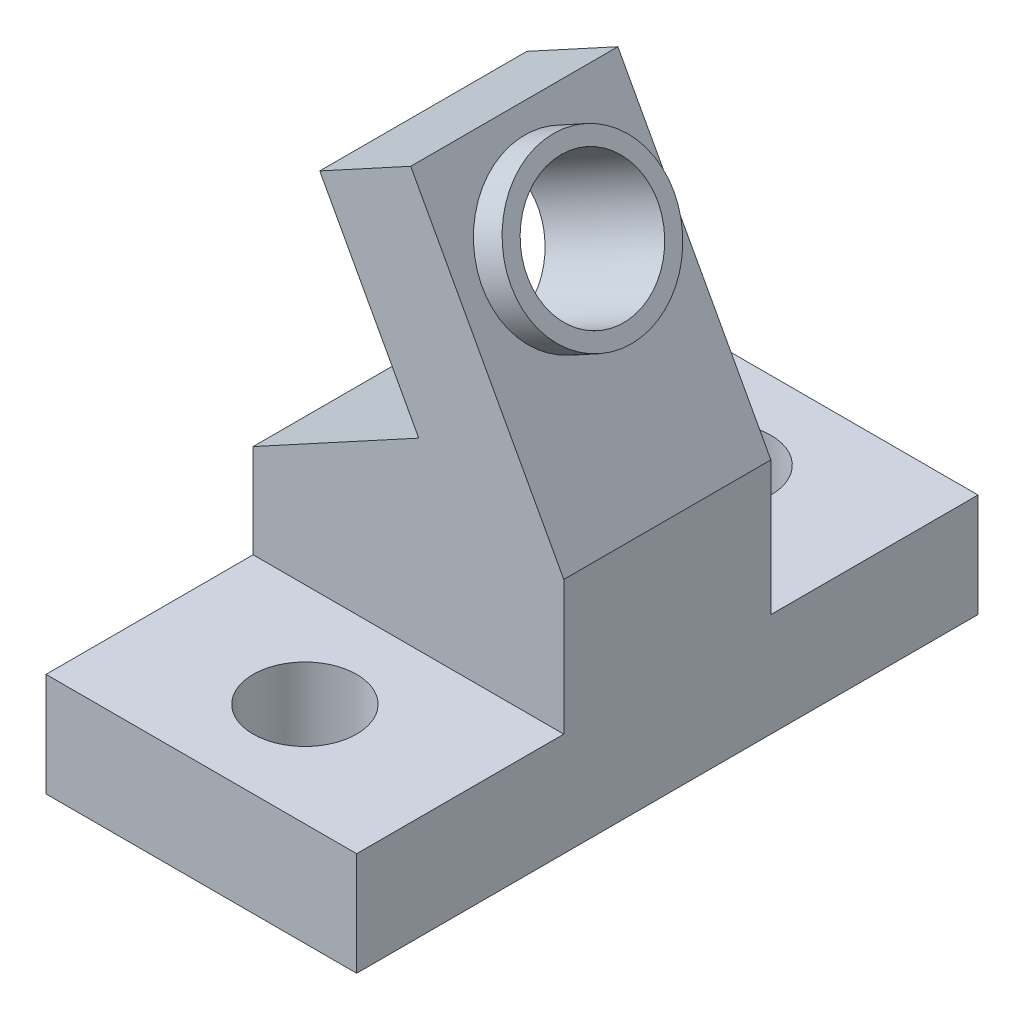
ISO-10303-21;
HEADER;
FILE_DESCRIPTION(('STEP AP214'),'2;1');
FILE_NAME('part.step','',(''),(''),'','','');
FILE_SCHEMA(('AUTOMOTIVE_DESIGN { 1 0 10303 214 1 1 1 1 }'));
ENDSEC;
DATA;
#1=APPLICATION_CONTEXT('core data for automotive mechanical design processes');
#2=APPLICATION_PROTOCOL_DEFINITION('international standard','automotive_design',2000,#1);
#3=PRODUCT_CONTEXT('',#1,'mechanical');
#4=PRODUCT('Part','Part','',(#3));
#5=PRODUCT_RELATED_PRODUCT_CATEGORY('part','',(#4));
#6=PRODUCT_DEFINITION_FORMATION('','',#4);
#7=PRODUCT_DEFINITION_CONTEXT('part definition',#1,'design');
#8=PRODUCT_DEFINITION('design','',#6,#7);
#9=PRODUCT_DEFINITION_SHAPE('','',#8);
#10=(LENGTH_UNIT() NAMED_UNIT(*) SI_UNIT(.MILLI.,.METRE.));
#11=(NAMED_UNIT(*) PLANE_ANGLE_UNIT() SI_UNIT($,.RADIAN.));
#12=(NAMED_UNIT(*) SI_UNIT($,.STERADIAN.) SOLID_ANGLE_UNIT());
#13=UNCERTAINTY_MEASURE_WITH_UNIT(LENGTH_MEASURE(1.E-05),#10,'distance_accuracy_value','');
#14=(GEOMETRIC_REPRESENTATION_CONTEXT(3) GLOBAL_UNCERTAINTY_ASSIGNED_CONTEXT((#13)) GLOBAL_UNIT_ASSIGNED_CONTEXT((#10,
#11,#12)) REPRESENTATION_CONTEXT('',''));
#15=CARTESIAN_POINT('',(0.,0.,0.));
#16=DIRECTION('',(0.,0.,1.));
#17=DIRECTION('',(1.,0.,0.));
#18=AXIS2_PLACEMENT_3D('',#15,#16,#17);
#19=CARTESIAN_POINT('',(12.7,2.89358929940263,12.7));
#20=DIRECTION('',(-0.878400378515024,-0.477925491080632,0.));
#21=DIRECTION('',(0.477925491080632,-0.878400378515024,0.));
#22=AXIS2_PLACEMENT_3D('',#19,#20,#21);
#23=PLANE('',#22);
#24=DIRECTION('',(-0.477925491080632,0.878400378515024,0.));
#25=VECTOR('',#24,1.);
#26=CARTESIAN_POINT('',(12.7,2.89358929940263,0.));
#27=LINE('',#26,#25);
#28=CARTESIAN_POINT('',(6.34999999999999,14.5645348916924,0.));
#29=VERTEX_POINT('',#28);
#30=CARTESIAN_POINT('',(-3.03482686836203,31.8133228875525,0.));
#31=VERTEX_POINT('',#30);
#32=EDGE_CURVE('E133',#29,#31,#27,.T.);
#33=ORIENTED_EDGE('',*,*,#32,.T.);
#34=DIRECTION('',(0.,0.,1.));
#35=VECTOR('',#34,1.);
#36=CARTESIAN_POINT('',(-3.03482686836203,31.8133228875525,0.));
#37=LINE('',#36,#35);
#38=CARTESIAN_POINT('',(-3.03482686836203,31.8133228875525,12.7));
#39=VERTEX_POINT('',#38);
#40=EDGE_CURVE('E118',#31,#39,#37,.T.);
#41=ORIENTED_EDGE('',*,*,#40,.T.);
#42=DIRECTION('',(-0.477925491080632,0.878400378515024,0.));
#43=VECTOR('',#42,1.);
#44=CARTESIAN_POINT('',(12.7,2.89358929940263,12.7));
#45=LINE('',#44,#43);
#46=CARTESIAN_POINT('',(6.34999999999999,14.5645348916924,12.7));
#47=VERTEX_POINT('',#46);
#48=EDGE_CURVE('E142',#47,#39,#45,.T.);
#49=ORIENTED_EDGE('',*,*,#48,.F.);
#50=DIRECTION('',(0.,0.,1.));
#51=VECTOR('',#50,1.);
#52=CARTESIAN_POINT('',(6.34999999999999,14.5645348916924,0.));
#53=LINE('',#52,#51);
#54=EDGE_CURVE('E138',#29,#47,#53,.T.);
#55=ORIENTED_EDGE('',*,*,#54,.F.);
#56=EDGE_LOOP('',(#33,#41,#49,#55));
#57=FACE_BOUND('',#56,.T.);
#58=CARTESIAN_POINT('',(0.,26.2354804839821,6.35000000000001));
#59=DIRECTION('',(-0.878400378515024,-0.477925491080632,0.));
#60=DIRECTION('',(0.477925491080632,-0.878400378515024,0.));
#61=AXIS2_PLACEMENT_3D('',#58,#59,#60);
#62=CIRCLE('',#61,5.);
#63=CARTESIAN_POINT('',(2.38962745540315,21.843478591407,6.35000000000001));
#64=VERTEX_POINT('',#63);
#65=EDGE_CURVE('E11',#64,#64,#62,.F.);
#66=ORIENTED_EDGE('',*,*,#65,.F.);
#67=EDGE_LOOP('',(#66));
#68=FACE_BOUND('',#67,.T.);
#69=ADVANCED_FACE('F33',(#57,#68),#23,.F.);
#70=CARTESIAN_POINT('',(-12.7,49.5773716685615,12.7));
#71=DIRECTION('',(1.,0.,0.));
#72=DIRECTION('',(0.,1.,0.));
#73=AXIS2_PLACEMENT_3D('',#70,#71,#72);
#74=PLANE('',#73);
#75=DIRECTION('',(0.,-1.,0.));
#76=VECTOR('',#75,1.);
#77=CARTESIAN_POINT('',(-12.7,49.5773716685615,12.7));
#78=LINE('',#77,#76);
#79=CARTESIAN_POINT('',(-12.7,12.0965365120771,12.7));
#80=VERTEX_POINT('',#79);
#81=CARTESIAN_POINT('',(-12.7,6.35,12.7));
#82=VERTEX_POINT('',#81);
#83=EDGE_CURVE('E139',#80,#82,#78,.T.);
#84=ORIENTED_EDGE('',*,*,#83,.F.);
#85=DIRECTION('',(0.,0.,1.));
#86=VECTOR('',#85,1.);
#87=CARTESIAN_POINT('',(-12.7,12.0965365120771,0.));
#88=LINE('',#87,#86);
#89=CARTESIAN_POINT('',(-12.7,12.0965365120771,0.));
#90=VERTEX_POINT('',#89);
#91=EDGE_CURVE('E181',#90,#80,#88,.T.);
#92=ORIENTED_EDGE('',*,*,#91,.F.);
#93=DIRECTION('',(0.,-1.,0.));
#94=VECTOR('',#93,1.);
#95=CARTESIAN_POINT('',(-12.7,49.5773716685615,0.));
#96=LINE('',#95,#94);
#97=CARTESIAN_POINT('',(-12.7,6.35,0.));
#98=VERTEX_POINT('',#97);
#99=EDGE_CURVE('E140',#90,#98,#96,.T.);
#100=ORIENTED_EDGE('',*,*,#99,.T.);
#101=DIRECTION('',(0.,0.,1.));
#102=VECTOR('',#101,1.);
#103=CARTESIAN_POINT('',(-12.7,6.35,-12.7));
#104=LINE('',#103,#102);
#105=CARTESIAN_POINT('',(-12.7,6.35,-12.7));
#106=VERTEX_POINT('',#105);
#107=EDGE_CURVE('E49',#106,#98,#104,.T.);
#108=ORIENTED_EDGE('',*,*,#107,.F.);
#109=DIRECTION('',(0.,-1.,0.));
#110=VECTOR('',#109,1.);
#111=CARTESIAN_POINT('',(-12.7,6.35,-12.7));
#112=LINE('',#111,#110);
#113=CARTESIAN_POINT('',(-12.7,0.,-12.7));
#114=VERTEX_POINT('',#113);
#115=EDGE_CURVE('E209',#106,#114,#112,.T.);
#116=ORIENTED_EDGE('',*,*,#115,.T.);
#117=DIRECTION('',(0.,0.,-1.));
#118=VECTOR('',#117,1.);
#119=CARTESIAN_POINT('',(-12.7,0.,12.7));
#120=LINE('',#119,#118);
#121=CARTESIAN_POINT('',(-12.7,0.,25.4));
#122=VERTEX_POINT('',#121);
#123=EDGE_CURVE('E42',#122,#114,#120,.T.);
#124=ORIENTED_EDGE('',*,*,#123,.F.);
#125=DIRECTION('',(0.,-1.,0.));
#126=VECTOR('',#125,1.);
#127=CARTESIAN_POINT('',(-12.7,6.35,25.4));
#128=LINE('',#127,#126);
#129=CARTESIAN_POINT('',(-12.7,6.35,25.4));
#130=VERTEX_POINT('',#129);
#131=EDGE_CURVE('E173',#130,#122,#128,.T.);
#132=ORIENTED_EDGE('',*,*,#131,.F.);
#133=DIRECTION('',(0.,0.,-1.));
#134=VECTOR('',#133,1.);
#135=CARTESIAN_POINT('',(-12.7,6.35,25.4));
#136=LINE('',#135,#134);
#137=EDGE_CURVE('E166',#130,#82,#136,.T.);
#138=ORIENTED_EDGE('',*,*,#137,.T.);
#139=EDGE_LOOP('',(#84,#92,#100,#108,#116,#124,#132,#138));
#140=FACE_BOUND('',#139,.T.);
#141=ADVANCED_FACE('F35',(#140),#74,.F.);
#142=CARTESIAN_POINT('',(-12.7,0.,12.7));
#143=DIRECTION('',(0.,1.,0.));
#144=DIRECTION('',(-1.,0.,0.));
#145=AXIS2_PLACEMENT_3D('',#142,#143,#144);
#146=PLANE('',#145);
#147=CARTESIAN_POINT('',(-3.17500000000001,0.,-6.35));
#148=DIRECTION('',(0.,1.,0.));
#149=DIRECTION('',(-1.,0.,0.));
#150=AXIS2_PLACEMENT_3D('',#147,#148,#149);
#151=CIRCLE('',#150,3.175);
#152=CARTESIAN_POINT('',(-6.35000000000001,0.,-6.35));
#153=VERTEX_POINT('',#152);
#154=EDGE_CURVE('E210',#153,#153,#151,.F.);
#155=ORIENTED_EDGE('',*,*,#154,.F.);
#156=EDGE_LOOP('',(#155));
#157=FACE_BOUND('',#156,.T.);
#158=CARTESIAN_POINT('',(-3.17500000000001,0.,19.05));
#159=DIRECTION('',(0.,1.,0.));
#160=DIRECTION('',(-1.,0.,0.));
#161=AXIS2_PLACEMENT_3D('',#158,#159,#160);
#162=CIRCLE('',#161,3.175);
#163=CARTESIAN_POINT('',(-6.35000000000001,0.,19.05));
#164=VERTEX_POINT('',#163);
#165=EDGE_CURVE('E194',#164,#164,#162,.T.);
#166=ORIENTED_EDGE('',*,*,#165,.T.);
#167=EDGE_LOOP('',(#166));
#168=FACE_BOUND('',#167,.T.);
#169=DIRECTION('',(1.,0.,0.));
#170=VECTOR('',#169,1.);
#171=CARTESIAN_POINT('',(-12.7,0.,-12.7));
#172=LINE('',#171,#170);
#173=CARTESIAN_POINT('',(6.34999999999999,0.,-12.7));
#174=VERTEX_POINT('',#173);
#175=EDGE_CURVE('E206',#114,#174,#172,.T.);
#176=ORIENTED_EDGE('',*,*,#175,.T.);
#177=DIRECTION('',(0.,0.,-1.));
#178=VECTOR('',#177,1.);
#179=CARTESIAN_POINT('',(6.34999999999999,0.,25.4));
#180=LINE('',#179,#178);
#181=CARTESIAN_POINT('',(6.34999999999999,0.,25.4));
#182=VERTEX_POINT('',#181);
#183=EDGE_CURVE('E161',#182,#174,#180,.T.);
#184=ORIENTED_EDGE('',*,*,#183,.F.);
#185=DIRECTION('',(1.,0.,0.));
#186=VECTOR('',#185,1.);
#187=CARTESIAN_POINT('',(-12.7,0.,25.4));
#188=LINE('',#187,#186);
#189=EDGE_CURVE('E177',#122,#182,#188,.T.);
#190=ORIENTED_EDGE('',*,*,#189,.F.);
#191=ORIENTED_EDGE('',*,*,#123,.T.);
#192=EDGE_LOOP('',(#176,#184,#190,#191));
#193=FACE_BOUND('',#192,.T.);
#194=ADVANCED_FACE('F253',(#157,#168,#193),#146,.F.);
#195=CARTESIAN_POINT('',(0.,0.,12.7));
#196=DIRECTION('',(0.,0.,1.));
#197=DIRECTION('',(1.,0.,0.));
#198=AXIS2_PLACEMENT_3D('',#195,#196,#197);
#199=PLANE('',#198);
#200=DIRECTION('',(0.878400378515023,0.477925491080633,0.));
#201=VECTOR('',#200,1.);
#202=CARTESIAN_POINT('',(-12.7,26.5546359285072,12.7));
#203=LINE('',#202,#201);
#204=CARTESIAN_POINT('',(-8.61266927193243,28.7784960191905,12.7));
#205=VERTEX_POINT('',#204);
#206=EDGE_CURVE('E123',#205,#39,#203,.T.);
#207=ORIENTED_EDGE('',*,*,#206,.F.);
#208=DIRECTION('',(-0.477925491080632,0.878400378515024,0.));
#209=VECTOR('',#208,1.);
#210=CARTESIAN_POINT('',(-8.61266927193243,28.7784960191905,12.7));
#211=LINE('',#210,#209);
#212=CARTESIAN_POINT('',(-2.5430155352084,17.6228112120497,12.7));
#213=VERTEX_POINT('',#212);
#214=EDGE_CURVE('E187',#213,#205,#211,.T.);
#215=ORIENTED_EDGE('',*,*,#214,.F.);
#216=DIRECTION('',(0.878400378515024,0.477925491080631,0.));
#217=VECTOR('',#216,1.);
#218=CARTESIAN_POINT('',(-2.5430155352084,17.6228112120497,12.7));
#219=LINE('',#218,#217);
#220=EDGE_CURVE('E191',#80,#213,#219,.T.);
#221=ORIENTED_EDGE('',*,*,#220,.F.);
#222=ORIENTED_EDGE('',*,*,#83,.T.);
#223=DIRECTION('',(-1.,0.,0.));
#224=VECTOR('',#223,1.);
#225=CARTESIAN_POINT('',(-12.7,6.35,12.7));
#226=LINE('',#225,#224);
#227=CARTESIAN_POINT('',(6.34999999999999,6.35,12.7));
#228=VERTEX_POINT('',#227);
#229=EDGE_CURVE('E170',#228,#82,#226,.T.);
#230=ORIENTED_EDGE('',*,*,#229,.F.);
#231=DIRECTION('',(0.,-1.,0.));
#232=VECTOR('',#231,1.);
#233=CARTESIAN_POINT('',(6.34999999999999,0.,12.7));
#234=LINE('',#233,#232);
#235=EDGE_CURVE('E224',#47,#228,#234,.T.);
#236=ORIENTED_EDGE('',*,*,#235,.F.);
#237=ORIENTED_EDGE('',*,*,#48,.T.);
#238=EDGE_LOOP('',(#207,#215,#221,#222,#230,#236,#237));
#239=FACE_BOUND('',#238,.T.);
#240=ADVANCED_FACE('F258',(#239),#199,.T.);
#241=CARTESIAN_POINT('',(0.,0.,0.));
#242=DIRECTION('',(0.,0.,1.));
#243=DIRECTION('',(1.,0.,0.));
#244=AXIS2_PLACEMENT_3D('',#241,#242,#243);
#245=PLANE('',#244);
#246=DIRECTION('',(-0.477925491080632,0.878400378515024,0.));
#247=VECTOR('',#246,1.);
#248=CARTESIAN_POINT('',(-8.61266927193243,28.7784960191905,0.));
#249=LINE('',#248,#247);
#250=CARTESIAN_POINT('',(-2.5430155352084,17.6228112120497,0.));
#251=VERTEX_POINT('',#250);
#252=CARTESIAN_POINT('',(-8.61266927193243,28.7784960191905,0.));
#253=VERTEX_POINT('',#252);
#254=EDGE_CURVE('E57',#251,#253,#249,.T.);
#255=ORIENTED_EDGE('',*,*,#254,.T.);
#256=DIRECTION('',(0.878400378515023,0.477925491080633,0.));
#257=VECTOR('',#256,1.);
#258=CARTESIAN_POINT('',(-12.7,26.5546359285072,0.));
#259=LINE('',#258,#257);
#260=EDGE_CURVE('E121',#253,#31,#259,.T.);
#261=ORIENTED_EDGE('',*,*,#260,.T.);
#262=ORIENTED_EDGE('',*,*,#32,.F.);
#263=DIRECTION('',(0.,-1.,0.));
#264=VECTOR('',#263,1.);
#265=CARTESIAN_POINT('',(6.34999999999999,0.,0.));
#266=LINE('',#265,#264);
#267=CARTESIAN_POINT('',(6.34999999999999,6.35,0.));
#268=VERTEX_POINT('',#267);
#269=EDGE_CURVE('E223',#29,#268,#266,.T.);
#270=ORIENTED_EDGE('',*,*,#269,.T.);
#271=DIRECTION('',(-1.,0.,0.));
#272=VECTOR('',#271,1.);
#273=CARTESIAN_POINT('',(-12.7,6.35,0.));
#274=LINE('',#273,#272);
#275=EDGE_CURVE('E207',#268,#98,#274,.T.);
#276=ORIENTED_EDGE('',*,*,#275,.T.);
#277=ORIENTED_EDGE('',*,*,#99,.F.);
#278=DIRECTION('',(0.878400378515024,0.477925491080631,0.));
#279=VECTOR('',#278,1.);
#280=CARTESIAN_POINT('',(-2.5430155352084,17.6228112120497,0.));
#281=LINE('',#280,#279);
#282=EDGE_CURVE('E190',#90,#251,#281,.T.);
#283=ORIENTED_EDGE('',*,*,#282,.T.);
#284=EDGE_LOOP('',(#255,#261,#262,#270,#276,#277,#283));
#285=FACE_BOUND('',#284,.T.);
#286=ADVANCED_FACE('F132',(#285),#245,.F.);
#287=CARTESIAN_POINT('',(-20.8142644393221,14.9107272200295,6.35000000000001));
#288=DIRECTION('',(0.878400378515024,0.477925491080631,0.));
#289=DIRECTION('',(-0.477925491080632,0.878400378515024,0.));
#290=AXIS2_PLACEMENT_3D('',#287,#288,#289);
#291=CYLINDRICAL_SURFACE('',#290,4.00000000000001);
#292=CARTESIAN_POINT('',(-5.57784240357041,23.2006536156201,6.35000000000001));
#293=DIRECTION('',(0.878400378515024,0.477925491080632,0.));
#294=DIRECTION('',(-0.477925491080632,0.878400378515024,0.));
#295=AXIS2_PLACEMENT_3D('',#292,#293,#294);
#296=CIRCLE('',#295,4.00000000000001);
#297=CARTESIAN_POINT('',(-7.48954436789294,26.7142551296802,6.35000000000001));
#298=VERTEX_POINT('',#297);
#299=EDGE_CURVE('E37',#298,#298,#296,.F.);
#300=ORIENTED_EDGE('',*,*,#299,.T.);
#301=EDGE_LOOP('',(#300));
#302=FACE_BOUND('',#301,.T.);
#303=CARTESIAN_POINT('',(1.75680075703004,27.1913314661433,6.35000000000001));
#304=DIRECTION('',(0.878400378515024,0.477925491080632,0.));
#305=DIRECTION('',(-0.477925491080632,0.878400378515024,0.));
#306=AXIS2_PLACEMENT_3D('',#303,#304,#305);
#307=CIRCLE('',#306,4.00000000000001);
#308=CARTESIAN_POINT('',(-0.15490120729249,30.7049329802034,6.35000000000001));
#309=VERTEX_POINT('',#308);
#310=EDGE_CURVE('E158',#309,#309,#307,.T.);
#311=ORIENTED_EDGE('',*,*,#310,.T.);
#312=EDGE_LOOP('',(#311));
#313=FACE_BOUND('',#312,.T.);
#314=ADVANCED_FACE('F303',(#302,#313),#291,.F.);
#315=CARTESIAN_POINT('',(1.75680075703004,27.1913314661433,6.35000000000001));
#316=DIRECTION('',(0.878400378515024,0.477925491080632,0.));
#317=DIRECTION('',(-0.477925491080632,0.878400378515024,0.));
#318=AXIS2_PLACEMENT_3D('',#315,#316,#317);
#319=PLANE('',#318);
#320=CARTESIAN_POINT('',(1.75680075703004,27.1913314661433,6.35000000000001));
#321=DIRECTION('',(0.878400378515024,0.477925491080632,0.));
#322=DIRECTION('',(-0.477925491080632,0.878400378515024,0.));
#323=AXIS2_PLACEMENT_3D('',#320,#321,#322);
#324=CIRCLE('',#323,5.);
#325=CARTESIAN_POINT('',(-0.63282669837312,31.5833333587185,6.35000000000001));
#326=VERTEX_POINT('',#325);
#327=EDGE_CURVE('E145',#326,#326,#324,.T.);
#328=ORIENTED_EDGE('',*,*,#327,.T.);
#329=EDGE_LOOP('',(#328));
#330=FACE_BOUND('',#329,.T.);
#331=ORIENTED_EDGE('',*,*,#310,.F.);
#332=EDGE_LOOP('',(#331));
#333=FACE_BOUND('',#332,.T.);
#334=ADVANCED_FACE('F300',(#330,#333),#319,.T.);
#335=CARTESIAN_POINT('',(1.75680075703004,27.1913314661433,6.35000000000001));
#336=DIRECTION('',(-0.878400378515024,-0.477925491080632,0.));
#337=DIRECTION('',(0.477925491080632,-0.878400378515024,0.));
#338=AXIS2_PLACEMENT_3D('',#335,#336,#337);
#339=CYLINDRICAL_SURFACE('',#338,5.);
#340=ORIENTED_EDGE('',*,*,#327,.F.);
#341=EDGE_LOOP('',(#340));
#342=FACE_BOUND('',#341,.T.);
#343=ORIENTED_EDGE('',*,*,#65,.T.);
#344=EDGE_LOOP('',(#343));
#345=FACE_BOUND('',#344,.T.);
#346=ADVANCED_FACE('F299',(#342,#345),#339,.T.);
#347=CARTESIAN_POINT('',(6.34999999999999,6.35,25.4));
#348=DIRECTION('',(-1.,0.,0.));
#349=DIRECTION('',(0.,0.,1.));
#350=AXIS2_PLACEMENT_3D('',#347,#348,#349);
#351=PLANE('',#350);
#352=ORIENTED_EDGE('',*,*,#183,.T.);
#353=DIRECTION('',(0.,1.,0.));
#354=VECTOR('',#353,1.);
#355=CARTESIAN_POINT('',(6.34999999999999,6.35,-12.7));
#356=LINE('',#355,#354);
#357=CARTESIAN_POINT('',(6.34999999999999,6.35,-12.7));
#358=VERTEX_POINT('',#357);
#359=EDGE_CURVE('E212',#174,#358,#356,.T.);
#360=ORIENTED_EDGE('',*,*,#359,.T.);
#361=DIRECTION('',(0.,0.,1.));
#362=VECTOR('',#361,1.);
#363=CARTESIAN_POINT('',(6.34999999999999,6.35,-12.7));
#364=LINE('',#363,#362);
#365=EDGE_CURVE('E203',#358,#268,#364,.T.);
#366=ORIENTED_EDGE('',*,*,#365,.T.);
#367=ORIENTED_EDGE('',*,*,#269,.F.);
#368=ORIENTED_EDGE('',*,*,#54,.T.);
#369=ORIENTED_EDGE('',*,*,#235,.T.);
#370=DIRECTION('',(0.,0.,-1.));
#371=VECTOR('',#370,1.);
#372=CARTESIAN_POINT('',(6.34999999999999,6.35,25.4));
#373=LINE('',#372,#371);
#374=CARTESIAN_POINT('',(6.34999999999999,6.35,25.4));
#375=VERTEX_POINT('',#374);
#376=EDGE_CURVE('E163',#375,#228,#373,.T.);
#377=ORIENTED_EDGE('',*,*,#376,.F.);
#378=DIRECTION('',(0.,1.,0.));
#379=VECTOR('',#378,1.);
#380=CARTESIAN_POINT('',(6.34999999999999,6.35,25.4));
#381=LINE('',#380,#379);
#382=EDGE_CURVE('E175',#182,#375,#381,.T.);
#383=ORIENTED_EDGE('',*,*,#382,.F.);
#384=EDGE_LOOP('',(#352,#360,#366,#367,#368,#369,#377,#383));
#385=FACE_BOUND('',#384,.T.);
#386=ADVANCED_FACE('F229',(#385),#351,.F.);
#387=CARTESIAN_POINT('',(-12.7,6.35,25.4));
#388=DIRECTION('',(0.,-1.,0.));
#389=DIRECTION('',(0.,0.,-1.));
#390=AXIS2_PLACEMENT_3D('',#387,#388,#389);
#391=PLANE('',#390);
#392=CARTESIAN_POINT('',(-3.17500000000001,6.35,19.05));
#393=DIRECTION('',(0.,1.,0.));
#394=DIRECTION('',(0.,0.,1.));
#395=AXIS2_PLACEMENT_3D('',#392,#393,#394);
#396=CIRCLE('',#395,3.175);
#397=CARTESIAN_POINT('',(-3.17500000000001,6.35,22.225));
#398=VERTEX_POINT('',#397);
#399=EDGE_CURVE('E199',#398,#398,#396,.T.);
#400=ORIENTED_EDGE('',*,*,#399,.F.);
#401=EDGE_LOOP('',(#400));
#402=FACE_BOUND('',#401,.T.);
#403=ORIENTED_EDGE('',*,*,#229,.T.);
#404=ORIENTED_EDGE('',*,*,#137,.F.);
#405=DIRECTION('',(-1.,0.,0.));
#406=VECTOR('',#405,1.);
#407=CARTESIAN_POINT('',(-12.7,6.35,25.4));
#408=LINE('',#407,#406);
#409=EDGE_CURVE('E169',#375,#130,#408,.T.);
#410=ORIENTED_EDGE('',*,*,#409,.F.);
#411=ORIENTED_EDGE('',*,*,#376,.T.);
#412=EDGE_LOOP('',(#403,#404,#410,#411));
#413=FACE_BOUND('',#412,.T.);
#414=ADVANCED_FACE('F282',(#402,#413),#391,.F.);
#415=CARTESIAN_POINT('',(0.,0.,25.4));
#416=DIRECTION('',(0.,0.,1.));
#417=DIRECTION('',(1.,0.,0.));
#418=AXIS2_PLACEMENT_3D('',#415,#416,#417);
#419=PLANE('',#418);
#420=ORIENTED_EDGE('',*,*,#131,.T.);
#421=ORIENTED_EDGE('',*,*,#189,.T.);
#422=ORIENTED_EDGE('',*,*,#382,.T.);
#423=ORIENTED_EDGE('',*,*,#409,.T.);
#424=EDGE_LOOP('',(#420,#421,#422,#423));
#425=FACE_BOUND('',#424,.T.);
#426=ADVANCED_FACE('F285',(#425),#419,.T.);
#427=CARTESIAN_POINT('',(-8.61266927193243,28.7784960191905,0.));
#428=DIRECTION('',(0.878400378515024,0.477925491080632,0.));
#429=DIRECTION('',(-0.477925491080632,0.878400378515024,0.));
#430=AXIS2_PLACEMENT_3D('',#427,#428,#429);
#431=PLANE('',#430);
#432=ORIENTED_EDGE('',*,*,#214,.T.);
#433=DIRECTION('',(0.,0.,1.));
#434=VECTOR('',#433,1.);
#435=CARTESIAN_POINT('',(-8.61266927193243,28.7784960191905,0.));
#436=LINE('',#435,#434);
#437=EDGE_CURVE('E185',#253,#205,#436,.T.);
#438=ORIENTED_EDGE('',*,*,#437,.F.);
#439=ORIENTED_EDGE('',*,*,#254,.F.);
#440=DIRECTION('',(0.,0.,1.));
#441=VECTOR('',#440,1.);
#442=CARTESIAN_POINT('',(-2.5430155352084,17.6228112120497,0.));
#443=LINE('',#442,#441);
#444=EDGE_CURVE('E183',#251,#213,#443,.T.);
#445=ORIENTED_EDGE('',*,*,#444,.T.);
#446=EDGE_LOOP('',(#432,#438,#439,#445));
#447=FACE_BOUND('',#446,.T.);
#448=ORIENTED_EDGE('',*,*,#299,.F.);
#449=EDGE_LOOP('',(#448));
#450=FACE_BOUND('',#449,.T.);
#451=ADVANCED_FACE('F276',(#447,#450),#431,.F.);
#452=CARTESIAN_POINT('',(-2.5430155352084,17.6228112120497,0.));
#453=DIRECTION('',(0.477925491080631,-0.878400378515024,0.));
#454=DIRECTION('',(0.878400378515024,0.477925491080631,0.));
#455=AXIS2_PLACEMENT_3D('',#452,#453,#454);
#456=PLANE('',#455);
#457=ORIENTED_EDGE('',*,*,#220,.T.);
#458=ORIENTED_EDGE('',*,*,#444,.F.);
#459=ORIENTED_EDGE('',*,*,#282,.F.);
#460=ORIENTED_EDGE('',*,*,#91,.T.);
#461=EDGE_LOOP('',(#457,#458,#459,#460));
#462=FACE_BOUND('',#461,.T.);
#463=ADVANCED_FACE('F245',(#462),#456,.F.);
#464=CARTESIAN_POINT('',(-3.17500000000001,-6.35,19.05));
#465=DIRECTION('',(0.,1.,0.));
#466=DIRECTION('',(0.,0.,1.));
#467=AXIS2_PLACEMENT_3D('',#464,#465,#466);
#468=CYLINDRICAL_SURFACE('',#467,3.175);
#469=ORIENTED_EDGE('',*,*,#399,.T.);
#470=EDGE_LOOP('',(#469));
#471=FACE_BOUND('',#470,.T.);
#472=ORIENTED_EDGE('',*,*,#165,.F.);
#473=EDGE_LOOP('',(#472));
#474=FACE_BOUND('',#473,.T.);
#475=ADVANCED_FACE('F235',(#471,#474),#468,.F.);
#476=CARTESIAN_POINT('',(-12.7,6.35,-12.7));
#477=DIRECTION('',(0.,1.,0.));
#478=DIRECTION('',(0.,0.,1.));
#479=AXIS2_PLACEMENT_3D('',#476,#477,#478);
#480=PLANE('',#479);
#481=CARTESIAN_POINT('',(-3.17500000000001,6.35,-6.35));
#482=DIRECTION('',(0.,-1.,0.));
#483=DIRECTION('',(0.,0.,-1.));
#484=AXIS2_PLACEMENT_3D('',#481,#482,#483);
#485=CIRCLE('',#484,3.175);
#486=CARTESIAN_POINT('',(-3.17500000000001,6.35,-9.525));
#487=VERTEX_POINT('',#486);
#488=EDGE_CURVE('E128',#487,#487,#485,.T.);
#489=ORIENTED_EDGE('',*,*,#488,.T.);
#490=EDGE_LOOP('',(#489));
#491=FACE_BOUND('',#490,.T.);
#492=ORIENTED_EDGE('',*,*,#275,.F.);
#493=ORIENTED_EDGE('',*,*,#365,.F.);
#494=DIRECTION('',(-1.,0.,0.));
#495=VECTOR('',#494,1.);
#496=CARTESIAN_POINT('',(-12.7,6.35,-12.7));
#497=LINE('',#496,#495);
#498=EDGE_CURVE('E215',#358,#106,#497,.T.);
#499=ORIENTED_EDGE('',*,*,#498,.T.);
#500=ORIENTED_EDGE('',*,*,#107,.T.);
#501=EDGE_LOOP('',(#492,#493,#499,#500));
#502=FACE_BOUND('',#501,.T.);
#503=ADVANCED_FACE('F232',(#491,#502),#480,.T.);
#504=CARTESIAN_POINT('',(0.,0.,-12.7));
#505=DIRECTION('',(0.,0.,-1.));
#506=DIRECTION('',(1.,0.,0.));
#507=AXIS2_PLACEMENT_3D('',#504,#505,#506);
#508=PLANE('',#507);
#509=ORIENTED_EDGE('',*,*,#115,.F.);
#510=ORIENTED_EDGE('',*,*,#498,.F.);
#511=ORIENTED_EDGE('',*,*,#359,.F.);
#512=ORIENTED_EDGE('',*,*,#175,.F.);
#513=EDGE_LOOP('',(#509,#510,#511,#512));
#514=FACE_BOUND('',#513,.T.);
#515=ADVANCED_FACE('F234',(#514),#508,.T.);
#516=CARTESIAN_POINT('',(-3.17500000000001,-6.35,-6.35));
#517=DIRECTION('',(0.,1.,0.));
#518=DIRECTION('',(0.,0.,1.));
#519=AXIS2_PLACEMENT_3D('',#516,#517,#518);
#520=CYLINDRICAL_SURFACE('',#519,3.175);
#521=ORIENTED_EDGE('',*,*,#488,.F.);
#522=EDGE_LOOP('',(#521));
#523=FACE_BOUND('',#522,.T.);
#524=ORIENTED_EDGE('',*,*,#154,.T.);
#525=EDGE_LOOP('',(#524));
#526=FACE_BOUND('',#525,.T.);
#527=ADVANCED_FACE('F242',(#523,#526),#520,.F.);
#528=CARTESIAN_POINT('',(-12.7,26.5546359285072,0.));
#529=DIRECTION('',(0.477925491080633,-0.878400378515023,0.));
#530=DIRECTION('',(0.878400378515023,0.477925491080633,0.));
#531=AXIS2_PLACEMENT_3D('',#528,#529,#530);
#532=PLANE('',#531);
#533=ORIENTED_EDGE('',*,*,#206,.T.);
#534=ORIENTED_EDGE('',*,*,#40,.F.);
#535=ORIENTED_EDGE('',*,*,#260,.F.);
#536=ORIENTED_EDGE('',*,*,#437,.T.);
#537=EDGE_LOOP('',(#533,#534,#535,#536));
#538=FACE_BOUND('',#537,.T.);
#539=ADVANCED_FACE('F120',(#538),#532,.F.);
#540=CLOSED_SHELL('',(#69,#141,#194,#240,#286,#314,#334,#346,#386,#414,#426,#451,#463,#475,#503,
#515,#527,#539));
#541=MANIFOLD_SOLID_BREP('B2',#540);
#542=ADVANCED_BREP_SHAPE_REPRESENTATION('',(#18,#541),#14);
#543=SHAPE_DEFINITION_REPRESENTATION(#9,#542);
ENDSEC;
END-ISO-10303-21;
